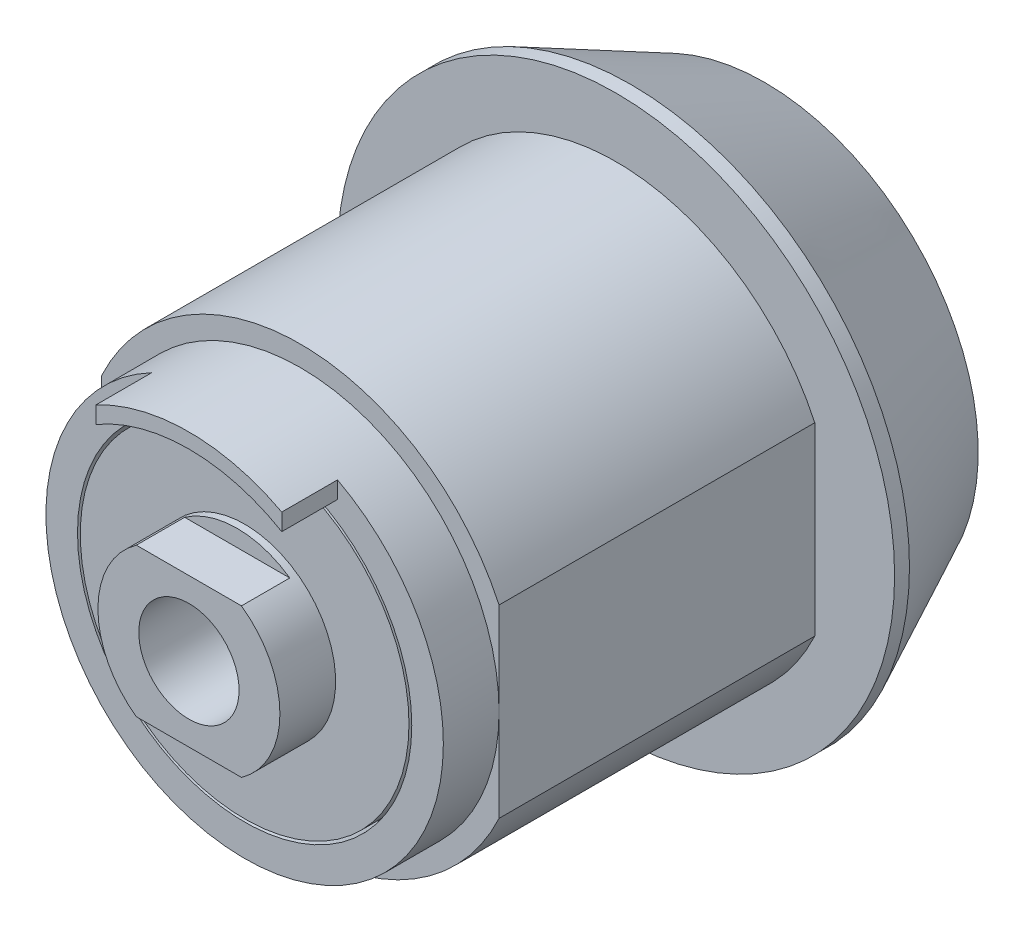
ISO-10303-21;
HEADER;
FILE_DESCRIPTION(('STEP AP214'),'2;1');
FILE_NAME('part.step','',(''),(''),'','','');
FILE_SCHEMA(('AUTOMOTIVE_DESIGN { 1 0 10303 214 1 1 1 1 }'));
ENDSEC;
DATA;
#1=APPLICATION_CONTEXT('core data for automotive mechanical design processes');
#2=APPLICATION_PROTOCOL_DEFINITION('international standard','automotive_design',2000,#1);
#3=PRODUCT_CONTEXT('',#1,'mechanical');
#4=PRODUCT('Part','Part','',(#3));
#5=PRODUCT_RELATED_PRODUCT_CATEGORY('part','',(#4));
#6=PRODUCT_DEFINITION_FORMATION('','',#4);
#7=PRODUCT_DEFINITION_CONTEXT('part definition',#1,'design');
#8=PRODUCT_DEFINITION('design','',#6,#7);
#9=PRODUCT_DEFINITION_SHAPE('','',#8);
#10=(LENGTH_UNIT() NAMED_UNIT(*) SI_UNIT(.MILLI.,.METRE.));
#11=(NAMED_UNIT(*) PLANE_ANGLE_UNIT() SI_UNIT($,.RADIAN.));
#12=(NAMED_UNIT(*) SI_UNIT($,.STERADIAN.) SOLID_ANGLE_UNIT());
#13=UNCERTAINTY_MEASURE_WITH_UNIT(LENGTH_MEASURE(1.E-05),#10,'distance_accuracy_value','');
#14=(GEOMETRIC_REPRESENTATION_CONTEXT(3) GLOBAL_UNCERTAINTY_ASSIGNED_CONTEXT((#13)) GLOBAL_UNIT_ASSIGNED_CONTEXT((#10,
#11,#12)) REPRESENTATION_CONTEXT('',''));
#15=CARTESIAN_POINT('',(0.,0.,0.));
#16=DIRECTION('',(0.,0.,1.));
#17=DIRECTION('',(1.,0.,0.));
#18=AXIS2_PLACEMENT_3D('',#15,#16,#17);
#19=CARTESIAN_POINT('',(0.,0.,10.5));
#20=DIRECTION('',(0.,0.,1.));
#21=DIRECTION('',(1.,0.,0.));
#22=AXIS2_PLACEMENT_3D('',#19,#20,#21);
#23=PLANE('',#22);
#24=CARTESIAN_POINT('',(0.,0.,10.5));
#25=DIRECTION('',(0.,0.,1.));
#26=DIRECTION('',(1.,0.,0.));
#27=AXIS2_PLACEMENT_3D('',#24,#25,#26);
#28=CIRCLE('',#27,1.35);
#29=CARTESIAN_POINT('',(1.35,0.,10.5));
#30=VERTEX_POINT('',#29);
#31=EDGE_CURVE('E19',#30,#30,#28,.T.);
#32=ORIENTED_EDGE('',*,*,#31,.T.);
#33=EDGE_LOOP('',(#32));
#34=FACE_BOUND('',#33,.T.);
#35=ADVANCED_FACE('F16',(#34),#23,.T.);
#36=CARTESIAN_POINT('',(0.,0.,10.5));
#37=DIRECTION('',(0.,0.,1.));
#38=DIRECTION('',(1.,0.,0.));
#39=AXIS2_PLACEMENT_3D('',#36,#37,#38);
#40=CYLINDRICAL_SURFACE('',#39,1.35);
#41=CARTESIAN_POINT('',(0.,0.,15.5));
#42=DIRECTION('',(0.,0.,1.));
#43=DIRECTION('',(1.,0.,0.));
#44=AXIS2_PLACEMENT_3D('',#41,#42,#43);
#45=CIRCLE('',#44,1.35);
#46=CARTESIAN_POINT('',(1.35,0.,15.5));
#47=VERTEX_POINT('',#46);
#48=EDGE_CURVE('E176',#47,#47,#45,.F.);
#49=ORIENTED_EDGE('',*,*,#48,.F.);
#50=EDGE_LOOP('',(#49));
#51=FACE_BOUND('',#50,.T.);
#52=ORIENTED_EDGE('',*,*,#31,.F.);
#53=EDGE_LOOP('',(#52));
#54=FACE_BOUND('',#53,.T.);
#55=ADVANCED_FACE('F760',(#51,#54),#40,.F.);
#56=CARTESIAN_POINT('',(-1.41509716980849,-2.,15.5));
#57=DIRECTION('',(0.,1.,0.));
#58=DIRECTION('',(0.,0.,1.));
#59=AXIS2_PLACEMENT_3D('',#56,#57,#58);
#60=PLANE('',#59);
#61=DIRECTION('',(1.,0.,0.));
#62=VECTOR('',#61,1.);
#63=CARTESIAN_POINT('',(0.,-2.,14.2));
#64=LINE('',#63,#62);
#65=CARTESIAN_POINT('',(1.41509716980849,-2.,14.2));
#66=VERTEX_POINT('',#65);
#67=CARTESIAN_POINT('',(-1.41509716980849,-2.,14.2));
#68=VERTEX_POINT('',#67);
#69=EDGE_CURVE('E163',#66,#68,#64,.F.);
#70=ORIENTED_EDGE('',*,*,#69,.F.);
#71=DIRECTION('',(0.,0.,1.));
#72=VECTOR('',#71,1.);
#73=CARTESIAN_POINT('',(1.41509716980849,-2.,15.5));
#74=LINE('',#73,#72);
#75=CARTESIAN_POINT('',(1.41509716980849,-2.,15.5));
#76=VERTEX_POINT('',#75);
#77=EDGE_CURVE('E171',#76,#66,#74,.F.);
#78=ORIENTED_EDGE('',*,*,#77,.F.);
#79=DIRECTION('',(1.,0.,0.));
#80=VECTOR('',#79,1.);
#81=CARTESIAN_POINT('',(0.,-2.,15.5));
#82=LINE('',#81,#80);
#83=CARTESIAN_POINT('',(-1.41509716980849,-2.,15.5));
#84=VERTEX_POINT('',#83);
#85=EDGE_CURVE('E166',#84,#76,#82,.T.);
#86=ORIENTED_EDGE('',*,*,#85,.F.);
#87=DIRECTION('',(0.,0.,1.));
#88=VECTOR('',#87,1.);
#89=CARTESIAN_POINT('',(-1.41509716980849,-2.,15.5));
#90=LINE('',#89,#88);
#91=EDGE_CURVE('E159',#68,#84,#90,.T.);
#92=ORIENTED_EDGE('',*,*,#91,.F.);
#93=EDGE_LOOP('',(#70,#78,#86,#92));
#94=FACE_BOUND('',#93,.T.);
#95=ADVANCED_FACE('F161',(#94),#60,.F.);
#96=CARTESIAN_POINT('',(-1.41509716980849,2.,15.5));
#97=DIRECTION('',(0.,-1.,0.));
#98=DIRECTION('',(0.,0.,-1.));
#99=AXIS2_PLACEMENT_3D('',#96,#97,#98);
#100=PLANE('',#99);
#101=DIRECTION('',(1.,0.,0.));
#102=VECTOR('',#101,1.);
#103=CARTESIAN_POINT('',(0.,2.,14.2));
#104=LINE('',#103,#102);
#105=CARTESIAN_POINT('',(-1.41509716980849,2.,14.2));
#106=VERTEX_POINT('',#105);
#107=CARTESIAN_POINT('',(1.41509716980849,2.,14.2));
#108=VERTEX_POINT('',#107);
#109=EDGE_CURVE('E199',#106,#108,#104,.T.);
#110=ORIENTED_EDGE('',*,*,#109,.F.);
#111=DIRECTION('',(0.,0.,-1.));
#112=VECTOR('',#111,1.);
#113=CARTESIAN_POINT('',(-1.41509716980849,2.,15.5));
#114=LINE('',#113,#112);
#115=CARTESIAN_POINT('',(-1.41509716980849,2.,15.5));
#116=VERTEX_POINT('',#115);
#117=EDGE_CURVE('E170',#116,#106,#114,.T.);
#118=ORIENTED_EDGE('',*,*,#117,.F.);
#119=DIRECTION('',(1.,0.,0.));
#120=VECTOR('',#119,1.);
#121=CARTESIAN_POINT('',(0.,2.,15.5));
#122=LINE('',#121,#120);
#123=CARTESIAN_POINT('',(1.41509716980849,2.,15.5));
#124=VERTEX_POINT('',#123);
#125=EDGE_CURVE('E194',#124,#116,#122,.F.);
#126=ORIENTED_EDGE('',*,*,#125,.F.);
#127=DIRECTION('',(0.,0.,-1.));
#128=VECTOR('',#127,1.);
#129=CARTESIAN_POINT('',(1.41509716980849,2.,15.5));
#130=LINE('',#129,#128);
#131=EDGE_CURVE('E177',#108,#124,#130,.F.);
#132=ORIENTED_EDGE('',*,*,#131,.F.);
#133=EDGE_LOOP('',(#110,#118,#126,#132));
#134=FACE_BOUND('',#133,.T.);
#135=ADVANCED_FACE('F321',(#134),#100,.F.);
#136=CARTESIAN_POINT('',(0.,0.,14.2));
#137=DIRECTION('',(0.,0.,1.));
#138=DIRECTION('',(1.,0.,0.));
#139=AXIS2_PLACEMENT_3D('',#136,#137,#138);
#140=PLANE('',#139);
#141=ORIENTED_EDGE('',*,*,#69,.T.);
#142=CARTESIAN_POINT('',(0.,0.,14.2));
#143=DIRECTION('',(0.,0.,-1.));
#144=DIRECTION('',(-1.,0.,0.));
#145=AXIS2_PLACEMENT_3D('',#142,#143,#144);
#146=CIRCLE('',#145,2.45);
#147=EDGE_CURVE('E175',#66,#68,#146,.T.);
#148=ORIENTED_EDGE('',*,*,#147,.F.);
#149=EDGE_LOOP('',(#141,#148));
#150=FACE_BOUND('',#149,.T.);
#151=ADVANCED_FACE('F174',(#150),#140,.T.);
#152=CARTESIAN_POINT('',(0.,0.,15.5));
#153=DIRECTION('',(0.,0.,1.));
#154=DIRECTION('',(1.,0.,0.));
#155=AXIS2_PLACEMENT_3D('',#152,#153,#154);
#156=PLANE('',#155);
#157=CARTESIAN_POINT('',(0.,0.,15.5));
#158=DIRECTION('',(0.,0.,-1.));
#159=DIRECTION('',(-1.,0.,0.));
#160=AXIS2_PLACEMENT_3D('',#157,#158,#159);
#161=CIRCLE('',#160,2.45);
#162=EDGE_CURVE('E182',#124,#76,#161,.T.);
#163=ORIENTED_EDGE('',*,*,#162,.F.);
#164=ORIENTED_EDGE('',*,*,#125,.T.);
#165=CARTESIAN_POINT('',(0.,0.,15.5));
#166=DIRECTION('',(0.,0.,-1.));
#167=DIRECTION('',(-1.,0.,0.));
#168=AXIS2_PLACEMENT_3D('',#165,#166,#167);
#169=CIRCLE('',#168,2.45);
#170=EDGE_CURVE('E185',#84,#116,#169,.T.);
#171=ORIENTED_EDGE('',*,*,#170,.F.);
#172=ORIENTED_EDGE('',*,*,#85,.T.);
#173=EDGE_LOOP('',(#163,#164,#171,#172));
#174=FACE_BOUND('',#173,.T.);
#175=ORIENTED_EDGE('',*,*,#48,.T.);
#176=EDGE_LOOP('',(#175));
#177=FACE_BOUND('',#176,.T.);
#178=ADVANCED_FACE('F318',(#174,#177),#156,.T.);
#179=CARTESIAN_POINT('',(0.,0.,14.2));
#180=DIRECTION('',(0.,0.,1.));
#181=DIRECTION('',(1.,0.,0.));
#182=AXIS2_PLACEMENT_3D('',#179,#180,#181);
#183=PLANE('',#182);
#184=ORIENTED_EDGE('',*,*,#109,.T.);
#185=CARTESIAN_POINT('',(0.,0.,14.2));
#186=DIRECTION('',(0.,0.,-1.));
#187=DIRECTION('',(-1.,0.,0.));
#188=AXIS2_PLACEMENT_3D('',#185,#186,#187);
#189=CIRCLE('',#188,2.45);
#190=EDGE_CURVE('E315',#106,#108,#189,.T.);
#191=ORIENTED_EDGE('',*,*,#190,.F.);
#192=EDGE_LOOP('',(#184,#191));
#193=FACE_BOUND('',#192,.T.);
#194=ADVANCED_FACE('F326',(#193),#183,.T.);
#195=CARTESIAN_POINT('',(0.,0.,0.));
#196=DIRECTION('',(0.,0.,1.));
#197=DIRECTION('',(1.,0.,0.));
#198=AXIS2_PLACEMENT_3D('',#195,#196,#197);
#199=PLANE('',#198);
#200=CARTESIAN_POINT('',(0.,0.,0.));
#201=DIRECTION('',(0.,0.,1.));
#202=DIRECTION('',(0.,-1.,0.));
#203=AXIS2_PLACEMENT_3D('',#200,#201,#202);
#204=CIRCLE('',#203,2.29999999999109);
#205=CARTESIAN_POINT('',(2.22036033110822,0.6,0.));
#206=VERTEX_POINT('',#205);
#207=CARTESIAN_POINT('',(2.22036033110822,-0.6,0.));
#208=VERTEX_POINT('',#207);
#209=EDGE_CURVE('E294',#206,#208,#204,.T.);
#210=ORIENTED_EDGE('',*,*,#209,.F.);
#211=DIRECTION('',(1.,0.,0.));
#212=VECTOR('',#211,1.);
#213=CARTESIAN_POINT('',(4.5,0.6,0.));
#214=LINE('',#213,#212);
#215=CARTESIAN_POINT('',(1.75,0.6,0.));
#216=VERTEX_POINT('',#215);
#217=EDGE_CURVE('E314',#206,#216,#214,.F.);
#218=ORIENTED_EDGE('',*,*,#217,.T.);
#219=DIRECTION('',(0.,1.,0.));
#220=VECTOR('',#219,1.);
#221=CARTESIAN_POINT('',(1.75,0.6,0.));
#222=LINE('',#221,#220);
#223=CARTESIAN_POINT('',(1.75,-0.6,0.));
#224=VERTEX_POINT('',#223);
#225=EDGE_CURVE('E188',#216,#224,#222,.F.);
#226=ORIENTED_EDGE('',*,*,#225,.T.);
#227=DIRECTION('',(1.,0.,0.));
#228=VECTOR('',#227,1.);
#229=CARTESIAN_POINT('',(0.,-0.6,0.));
#230=LINE('',#229,#228);
#231=EDGE_CURVE('E325',#208,#224,#230,.F.);
#232=ORIENTED_EDGE('',*,*,#231,.F.);
#233=EDGE_LOOP('',(#210,#218,#226,#232));
#234=FACE_BOUND('',#233,.T.);
#235=ADVANCED_FACE('F328',(#234),#199,.F.);
#236=CARTESIAN_POINT('',(1.75,0.6,8.0004166377355));
#237=DIRECTION('',(-1.,0.,0.));
#238=DIRECTION('',(0.,0.,1.));
#239=AXIS2_PLACEMENT_3D('',#236,#237,#238);
#240=PLANE('',#239);
#241=DIRECTION('',(0.,0.,-1.));
#242=VECTOR('',#241,1.);
#243=CARTESIAN_POINT('',(1.75,-0.6,8.0004166377355));
#244=LINE('',#243,#242);
#245=CARTESIAN_POINT('',(1.75,-0.6,5.));
#246=VERTEX_POINT('',#245);
#247=EDGE_CURVE('E293',#246,#224,#244,.T.);
#248=ORIENTED_EDGE('',*,*,#247,.T.);
#249=ORIENTED_EDGE('',*,*,#225,.F.);
#250=DIRECTION('',(0.,0.,1.));
#251=VECTOR('',#250,1.);
#252=CARTESIAN_POINT('',(1.75,0.6,8.0004166377355));
#253=LINE('',#252,#251);
#254=CARTESIAN_POINT('',(1.75,0.6,5.));
#255=VERTEX_POINT('',#254);
#256=EDGE_CURVE('E316',#216,#255,#253,.T.);
#257=ORIENTED_EDGE('',*,*,#256,.T.);
#258=DIRECTION('',(0.,1.,0.));
#259=VECTOR('',#258,1.);
#260=CARTESIAN_POINT('',(1.75,0.6,5.));
#261=LINE('',#260,#259);
#262=EDGE_CURVE('E183',#246,#255,#261,.T.);
#263=ORIENTED_EDGE('',*,*,#262,.F.);
#264=EDGE_LOOP('',(#248,#249,#257,#263));
#265=FACE_BOUND('',#264,.T.);
#266=ADVANCED_FACE('F335',(#265),#240,.F.);
#267=CARTESIAN_POINT('',(0.,0.,15.5));
#268=DIRECTION('',(0.,0.,-1.));
#269=DIRECTION('',(-1.,0.,0.));
#270=AXIS2_PLACEMENT_3D('',#267,#268,#269);
#271=CYLINDRICAL_SURFACE('',#270,2.45);
#272=CARTESIAN_POINT('',(0.,0.,14.));
#273=DIRECTION('',(0.,0.,-1.));
#274=DIRECTION('',(-1.,0.,0.));
#275=AXIS2_PLACEMENT_3D('',#272,#273,#274);
#276=CIRCLE('',#275,2.45);
#277=CARTESIAN_POINT('',(-2.45,0.,14.));
#278=VERTEX_POINT('',#277);
#279=EDGE_CURVE('E282',#278,#278,#276,.T.);
#280=ORIENTED_EDGE('',*,*,#279,.F.);
#281=EDGE_LOOP('',(#280));
#282=FACE_BOUND('',#281,.T.);
#283=ORIENTED_EDGE('',*,*,#190,.T.);
#284=ORIENTED_EDGE('',*,*,#131,.T.);
#285=ORIENTED_EDGE('',*,*,#162,.T.);
#286=ORIENTED_EDGE('',*,*,#77,.T.);
#287=ORIENTED_EDGE('',*,*,#147,.T.);
#288=ORIENTED_EDGE('',*,*,#91,.T.);
#289=ORIENTED_EDGE('',*,*,#170,.T.);
#290=ORIENTED_EDGE('',*,*,#117,.T.);
#291=EDGE_LOOP('',(#283,#284,#285,#286,#287,#288,#289,#290));
#292=FACE_BOUND('',#291,.T.);
#293=ADVANCED_FACE('F180',(#282,#292),#271,.T.);
#294=CARTESIAN_POINT('',(4.5,0.6,8.0004166377355));
#295=DIRECTION('',(0.,1.,0.));
#296=DIRECTION('',(0.,0.,1.));
#297=AXIS2_PLACEMENT_3D('',#294,#295,#296);
#298=PLANE('',#297);
#299=CARTESIAN_POINT('',(2.63248931621759,0.6,0.400000000008869));
#300=CARTESIAN_POINT('',(2.56396525927051,0.6,0.333164266625738));
#301=CARTESIAN_POINT('',(2.4953591528772,0.6,0.266413070630083));
#302=CARTESIAN_POINT('',(2.35798282454789,0.6,0.133079737253487));
#303=CARTESIAN_POINT('',(2.28921260257211,0.6,0.0664975999135306));
#304=CARTESIAN_POINT('',(2.22036033111033,0.6,2.0335586174442E-12));
#305=B_SPLINE_CURVE_WITH_KNOTS('',3,(#299,#300,#301,#302,#303,#304),.UNSPECIFIED.,.F.,.F.,(4,2,
4),(0.,0.287163159217367,0.574326388044106),.UNSPECIFIED.);
#306=CARTESIAN_POINT('',(2.63248931621761,0.6,0.400000000004435));
#307=VERTEX_POINT('',#306);
#308=EDGE_CURVE('E308',#307,#206,#305,.T.);
#309=ORIENTED_EDGE('',*,*,#308,.F.);
#310=DIRECTION('',(0.,0.,-1.));
#311=VECTOR('',#310,1.);
#312=CARTESIAN_POINT('',(2.63248931621764,0.6,5.));
#313=LINE('',#312,#311);
#314=CARTESIAN_POINT('',(2.63248931621764,0.6,5.));
#315=VERTEX_POINT('',#314);
#316=EDGE_CURVE('E527',#315,#307,#313,.T.);
#317=ORIENTED_EDGE('',*,*,#316,.F.);
#318=DIRECTION('',(1.,0.,0.));
#319=VECTOR('',#318,1.);
#320=CARTESIAN_POINT('',(4.5,0.6,5.));
#321=LINE('',#320,#319);
#322=EDGE_CURVE('E499',#255,#315,#321,.T.);
#323=ORIENTED_EDGE('',*,*,#322,.F.);
#324=ORIENTED_EDGE('',*,*,#256,.F.);
#325=ORIENTED_EDGE('',*,*,#217,.F.);
#326=EDGE_LOOP('',(#309,#317,#323,#324,#325));
#327=FACE_BOUND('',#326,.T.);
#328=ADVANCED_FACE('F303',(#327),#298,.F.);
#329=CARTESIAN_POINT('',(0.,0.,0.399999999899592));
#330=DIRECTION('',(0.,0.,1.));
#331=DIRECTION('',(0.,-1.,0.));
#332=AXIS2_PLACEMENT_3D('',#329,#330,#331);
#333=CONICAL_SURFACE('',#332,2.69999999989068,0.785398163397448);
#334=ORIENTED_EDGE('',*,*,#308,.T.);
#335=ORIENTED_EDGE('',*,*,#209,.T.);
#336=CARTESIAN_POINT('',(2.22036033111211,-0.6,3.75291312388091E-12));
#337=CARTESIAN_POINT('',(2.28921260257286,-0.6,0.0664975999142519));
#338=CARTESIAN_POINT('',(2.3579828245476,-0.6,0.133079737253208));
#339=CARTESIAN_POINT('',(2.49535915287485,-0.6,0.266413070627798));
#340=CARTESIAN_POINT('',(2.56396525926713,-0.6,0.333164266622447));
#341=CARTESIAN_POINT('',(2.63248931621318,-0.6,0.40000000000457));
#342=B_SPLINE_CURVE_WITH_KNOTS('',3,(#336,#337,#338,#339,#340,#341),.UNSPECIFIED.,.F.,.F.,(4,2,
4),(0.,0.287163228822422,0.574326388035472),.UNSPECIFIED.);
#343=CARTESIAN_POINT('',(2.63248931621541,-0.6,0.400000000002285));
#344=VERTEX_POINT('',#343);
#345=EDGE_CURVE('E286',#208,#344,#342,.T.);
#346=ORIENTED_EDGE('',*,*,#345,.T.);
#347=CARTESIAN_POINT('',(0.,0.,0.4));
#348=DIRECTION('',(0.,0.,-1.));
#349=DIRECTION('',(-1.,0.,0.));
#350=AXIS2_PLACEMENT_3D('',#347,#348,#349);
#351=CIRCLE('',#350,2.7);
#352=EDGE_CURVE('E525',#307,#344,#351,.F.);
#353=ORIENTED_EDGE('',*,*,#352,.F.);
#354=EDGE_LOOP('',(#334,#335,#346,#353));
#355=FACE_BOUND('',#354,.T.);
#356=ADVANCED_FACE('F299',(#355),#333,.T.);
#357=CARTESIAN_POINT('',(4.5,-0.6,8.0004166377355));
#358=DIRECTION('',(0.,-1.,0.));
#359=DIRECTION('',(0.,0.,-1.));
#360=AXIS2_PLACEMENT_3D('',#357,#358,#359);
#361=PLANE('',#360);
#362=ORIENTED_EDGE('',*,*,#345,.F.);
#363=ORIENTED_EDGE('',*,*,#231,.T.);
#364=ORIENTED_EDGE('',*,*,#247,.F.);
#365=DIRECTION('',(1.,0.,0.));
#366=VECTOR('',#365,1.);
#367=CARTESIAN_POINT('',(4.5,-0.6,5.));
#368=LINE('',#367,#366);
#369=CARTESIAN_POINT('',(2.63248931621764,-0.6,5.));
#370=VERTEX_POINT('',#369);
#371=EDGE_CURVE('E486',#370,#246,#368,.F.);
#372=ORIENTED_EDGE('',*,*,#371,.F.);
#373=DIRECTION('',(0.,0.,-1.));
#374=VECTOR('',#373,1.);
#375=CARTESIAN_POINT('',(2.63248931621764,-0.6,5.));
#376=LINE('',#375,#374);
#377=EDGE_CURVE('E281',#344,#370,#376,.F.);
#378=ORIENTED_EDGE('',*,*,#377,.F.);
#379=EDGE_LOOP('',(#362,#363,#364,#372,#378));
#380=FACE_BOUND('',#379,.T.);
#381=ADVANCED_FACE('F296',(#380),#361,.F.);
#382=CARTESIAN_POINT('',(0.,0.,14.));
#383=DIRECTION('',(0.,0.,1.));
#384=DIRECTION('',(1.,0.,0.));
#385=AXIS2_PLACEMENT_3D('',#382,#383,#384);
#386=PLANE('',#385);
#387=CARTESIAN_POINT('',(0.,0.,14.));
#388=DIRECTION('',(0.,0.,1.));
#389=DIRECTION('',(1.,0.,0.));
#390=AXIS2_PLACEMENT_3D('',#387,#388,#389);
#391=CIRCLE('',#390,4.425);
#392=CARTESIAN_POINT('',(4.425,0.,14.));
#393=VERTEX_POINT('',#392);
#394=EDGE_CURVE('E277',#393,#393,#391,.F.);
#395=ORIENTED_EDGE('',*,*,#394,.F.);
#396=EDGE_LOOP('',(#395));
#397=FACE_BOUND('',#396,.T.);
#398=ORIENTED_EDGE('',*,*,#279,.T.);
#399=EDGE_LOOP('',(#398));
#400=FACE_BOUND('',#399,.T.);
#401=ADVANCED_FACE('F456',(#397,#400),#386,.T.);
#402=CARTESIAN_POINT('',(0.6,-4.5,8.0004166377355));
#403=DIRECTION('',(0.,-1.,0.));
#404=DIRECTION('',(0.,0.,-1.));
#405=AXIS2_PLACEMENT_3D('',#402,#403,#404);
#406=PLANE('',#405);
#407=DIRECTION('',(0.,0.,1.));
#408=VECTOR('',#407,1.);
#409=CARTESIAN_POINT('',(0.6,-4.5,8.0004166377355));
#410=LINE('',#409,#408);
#411=CARTESIAN_POINT('',(0.6,-4.5,5.));
#412=VERTEX_POINT('',#411);
#413=CARTESIAN_POINT('',(0.6,-4.5,0.));
#414=VERTEX_POINT('',#413);
#415=EDGE_CURVE('E280',#412,#414,#410,.F.);
#416=ORIENTED_EDGE('',*,*,#415,.T.);
#417=DIRECTION('',(1.,0.,0.));
#418=VECTOR('',#417,1.);
#419=CARTESIAN_POINT('',(0.6,-4.5,0.));
#420=LINE('',#419,#418);
#421=CARTESIAN_POINT('',(-0.6,-4.5,0.));
#422=VERTEX_POINT('',#421);
#423=EDGE_CURVE('E285',#422,#414,#420,.T.);
#424=ORIENTED_EDGE('',*,*,#423,.F.);
#425=DIRECTION('',(0.,0.,1.));
#426=VECTOR('',#425,1.);
#427=CARTESIAN_POINT('',(-0.6,-4.5,8.0004166377355));
#428=LINE('',#427,#426);
#429=CARTESIAN_POINT('',(-0.6,-4.5,5.));
#430=VERTEX_POINT('',#429);
#431=EDGE_CURVE('E535',#422,#430,#428,.T.);
#432=ORIENTED_EDGE('',*,*,#431,.T.);
#433=DIRECTION('',(1.,0.,0.));
#434=VECTOR('',#433,1.);
#435=CARTESIAN_POINT('',(0.6,-4.5,5.));
#436=LINE('',#435,#434);
#437=EDGE_CURVE('E565',#412,#430,#436,.F.);
#438=ORIENTED_EDGE('',*,*,#437,.F.);
#439=EDGE_LOOP('',(#416,#424,#432,#438));
#440=FACE_BOUND('',#439,.T.);
#441=ADVANCED_FACE('F453',(#440),#406,.F.);
#442=CARTESIAN_POINT('',(4.5,0.6,8.0004166377355));
#443=DIRECTION('',(1.,0.,0.));
#444=DIRECTION('',(0.,0.,-1.));
#445=AXIS2_PLACEMENT_3D('',#442,#443,#444);
#446=PLANE('',#445);
#447=DIRECTION('',(0.,0.,1.));
#448=VECTOR('',#447,1.);
#449=CARTESIAN_POINT('',(4.5,0.6,8.0004166377355));
#450=LINE('',#449,#448);
#451=CARTESIAN_POINT('',(4.5,0.6,5.));
#452=VERTEX_POINT('',#451);
#453=CARTESIAN_POINT('',(4.5,0.6,0.));
#454=VERTEX_POINT('',#453);
#455=EDGE_CURVE('E538',#452,#454,#450,.F.);
#456=ORIENTED_EDGE('',*,*,#455,.T.);
#457=DIRECTION('',(0.,1.,0.));
#458=VECTOR('',#457,1.);
#459=CARTESIAN_POINT('',(4.5,0.6,0.));
#460=LINE('',#459,#458);
#461=CARTESIAN_POINT('',(4.5,-0.6,0.));
#462=VERTEX_POINT('',#461);
#463=EDGE_CURVE('E560',#462,#454,#460,.T.);
#464=ORIENTED_EDGE('',*,*,#463,.F.);
#465=DIRECTION('',(0.,0.,-1.));
#466=VECTOR('',#465,1.);
#467=CARTESIAN_POINT('',(4.5,-0.6,8.0004166377355));
#468=LINE('',#467,#466);
#469=CARTESIAN_POINT('',(4.5,-0.6,5.));
#470=VERTEX_POINT('',#469);
#471=EDGE_CURVE('E547',#462,#470,#468,.F.);
#472=ORIENTED_EDGE('',*,*,#471,.T.);
#473=DIRECTION('',(0.,1.,0.));
#474=VECTOR('',#473,1.);
#475=CARTESIAN_POINT('',(4.5,0.6,5.));
#476=LINE('',#475,#474);
#477=EDGE_CURVE('E534',#452,#470,#476,.F.);
#478=ORIENTED_EDGE('',*,*,#477,.F.);
#479=EDGE_LOOP('',(#456,#464,#472,#478));
#480=FACE_BOUND('',#479,.T.);
#481=ADVANCED_FACE('F449',(#480),#446,.F.);
#482=CARTESIAN_POINT('',(0.,0.,5.));
#483=DIRECTION('',(0.,0.,-1.));
#484=DIRECTION('',(-1.,0.,0.));
#485=AXIS2_PLACEMENT_3D('',#482,#483,#484);
#486=CYLINDRICAL_SURFACE('',#485,2.7);
#487=ORIENTED_EDGE('',*,*,#352,.T.);
#488=ORIENTED_EDGE('',*,*,#377,.T.);
#489=CARTESIAN_POINT('',(0.,0.,5.));
#490=DIRECTION('',(0.,0.,-1.));
#491=DIRECTION('',(-1.,0.,0.));
#492=AXIS2_PLACEMENT_3D('',#489,#490,#491);
#493=CIRCLE('',#492,2.7);
#494=EDGE_CURVE('E273',#315,#370,#493,.F.);
#495=ORIENTED_EDGE('',*,*,#494,.F.);
#496=ORIENTED_EDGE('',*,*,#316,.T.);
#497=EDGE_LOOP('',(#487,#488,#495,#496));
#498=FACE_BOUND('',#497,.T.);
#499=ADVANCED_FACE('F445',(#498),#486,.T.);
#500=CARTESIAN_POINT('',(0.,0.,13.));
#501=DIRECTION('',(0.,0.,1.));
#502=DIRECTION('',(1.,0.,0.));
#503=AXIS2_PLACEMENT_3D('',#500,#501,#502);
#504=CYLINDRICAL_SURFACE('',#503,4.425);
#505=CARTESIAN_POINT('',(0.,0.,13.));
#506=DIRECTION('',(0.,0.,1.));
#507=DIRECTION('',(1.,0.,0.));
#508=AXIS2_PLACEMENT_3D('',#505,#506,#507);
#509=CIRCLE('',#508,4.425);
#510=CARTESIAN_POINT('',(4.425,0.,13.));
#511=VERTEX_POINT('',#510);
#512=EDGE_CURVE('E269',#511,#511,#509,.F.);
#513=ORIENTED_EDGE('',*,*,#512,.F.);
#514=EDGE_LOOP('',(#513));
#515=FACE_BOUND('',#514,.T.);
#516=ORIENTED_EDGE('',*,*,#394,.T.);
#517=EDGE_LOOP('',(#516));
#518=FACE_BOUND('',#517,.T.);
#519=ADVANCED_FACE('F441',(#515,#518),#504,.T.);
#520=CARTESIAN_POINT('',(0.6,-3.,8.0004166377355));
#521=DIRECTION('',(1.,0.,0.));
#522=DIRECTION('',(0.,1.,0.));
#523=AXIS2_PLACEMENT_3D('',#520,#521,#522);
#524=PLANE('',#523);
#525=ORIENTED_EDGE('',*,*,#415,.F.);
#526=DIRECTION('',(0.,1.,0.));
#527=VECTOR('',#526,1.);
#528=CARTESIAN_POINT('',(0.6,0.,5.));
#529=LINE('',#528,#527);
#530=CARTESIAN_POINT('',(0.599999999999999,-3.54964786985977,5.));
#531=VERTEX_POINT('',#530);
#532=EDGE_CURVE('E617',#531,#412,#529,.F.);
#533=ORIENTED_EDGE('',*,*,#532,.F.);
#534=DIRECTION('',(0.,0.,-1.));
#535=VECTOR('',#534,1.);
#536=CARTESIAN_POINT('',(0.599999999999999,-3.54964786985977,5.));
#537=LINE('',#536,#535);
#538=CARTESIAN_POINT('',(0.599999999999999,-3.54964786985977,0.));
#539=VERTEX_POINT('',#538);
#540=EDGE_CURVE('E272',#531,#539,#537,.T.);
#541=ORIENTED_EDGE('',*,*,#540,.T.);
#542=DIRECTION('',(0.,1.,0.));
#543=VECTOR('',#542,1.);
#544=CARTESIAN_POINT('',(0.6,-3.,0.));
#545=LINE('',#544,#543);
#546=EDGE_CURVE('E544',#414,#539,#545,.T.);
#547=ORIENTED_EDGE('',*,*,#546,.F.);
#548=EDGE_LOOP('',(#525,#533,#541,#547));
#549=FACE_BOUND('',#548,.T.);
#550=ADVANCED_FACE('F437',(#549),#524,.F.);
#551=CARTESIAN_POINT('',(4.5,-0.6,8.0004166377355));
#552=DIRECTION('',(0.,-1.,0.));
#553=DIRECTION('',(0.,0.,-1.));
#554=AXIS2_PLACEMENT_3D('',#551,#552,#553);
#555=PLANE('',#554);
#556=ORIENTED_EDGE('',*,*,#471,.F.);
#557=DIRECTION('',(1.,0.,0.));
#558=VECTOR('',#557,1.);
#559=CARTESIAN_POINT('',(4.5,-0.6,0.));
#560=LINE('',#559,#558);
#561=CARTESIAN_POINT('',(3.54964786985977,-0.6,0.));
#562=VERTEX_POINT('',#561);
#563=EDGE_CURVE('E550',#562,#462,#560,.T.);
#564=ORIENTED_EDGE('',*,*,#563,.F.);
#565=DIRECTION('',(0.,0.,-1.));
#566=VECTOR('',#565,1.);
#567=CARTESIAN_POINT('',(3.54964786985977,-0.6,5.));
#568=LINE('',#567,#566);
#569=CARTESIAN_POINT('',(3.54964786985977,-0.6,5.));
#570=VERTEX_POINT('',#569);
#571=EDGE_CURVE('E268',#562,#570,#568,.F.);
#572=ORIENTED_EDGE('',*,*,#571,.T.);
#573=DIRECTION('',(-1.,0.,0.));
#574=VECTOR('',#573,1.);
#575=CARTESIAN_POINT('',(0.,-0.6,5.));
#576=LINE('',#575,#574);
#577=EDGE_CURVE('E612',#470,#570,#576,.T.);
#578=ORIENTED_EDGE('',*,*,#577,.F.);
#579=EDGE_LOOP('',(#556,#564,#572,#578));
#580=FACE_BOUND('',#579,.T.);
#581=ADVANCED_FACE('F433',(#580),#555,.F.);
#582=CARTESIAN_POINT('',(-0.6,-3.,8.0004166377355));
#583=DIRECTION('',(-1.,0.,0.));
#584=DIRECTION('',(0.,-1.,0.));
#585=AXIS2_PLACEMENT_3D('',#582,#583,#584);
#586=PLANE('',#585);
#587=ORIENTED_EDGE('',*,*,#431,.F.);
#588=DIRECTION('',(0.,-1.,0.));
#589=VECTOR('',#588,1.);
#590=CARTESIAN_POINT('',(-0.6,-3.,0.));
#591=LINE('',#590,#589);
#592=CARTESIAN_POINT('',(-0.599999999999999,-3.54964786985977,0.));
#593=VERTEX_POINT('',#592);
#594=EDGE_CURVE('E539',#593,#422,#591,.T.);
#595=ORIENTED_EDGE('',*,*,#594,.F.);
#596=DIRECTION('',(0.,0.,-1.));
#597=VECTOR('',#596,1.);
#598=CARTESIAN_POINT('',(-0.599999999999998,-3.54964786985977,5.));
#599=LINE('',#598,#597);
#600=CARTESIAN_POINT('',(-0.599999999999999,-3.54964786985977,5.));
#601=VERTEX_POINT('',#600);
#602=EDGE_CURVE('E267',#593,#601,#599,.F.);
#603=ORIENTED_EDGE('',*,*,#602,.T.);
#604=DIRECTION('',(0.,1.,0.));
#605=VECTOR('',#604,1.);
#606=CARTESIAN_POINT('',(-0.6,0.,5.));
#607=LINE('',#606,#605);
#608=EDGE_CURVE('E276',#430,#601,#607,.T.);
#609=ORIENTED_EDGE('',*,*,#608,.F.);
#610=EDGE_LOOP('',(#587,#595,#603,#609));
#611=FACE_BOUND('',#610,.T.);
#612=ADVANCED_FACE('F429',(#611),#586,.F.);
#613=CARTESIAN_POINT('',(4.5,0.6,8.0004166377355));
#614=DIRECTION('',(0.,1.,0.));
#615=DIRECTION('',(0.,0.,1.));
#616=AXIS2_PLACEMENT_3D('',#613,#614,#615);
#617=PLANE('',#616);
#618=ORIENTED_EDGE('',*,*,#455,.F.);
#619=DIRECTION('',(-1.,0.,0.));
#620=VECTOR('',#619,1.);
#621=CARTESIAN_POINT('',(0.,0.6,5.));
#622=LINE('',#621,#620);
#623=CARTESIAN_POINT('',(3.54964786985977,0.6,5.));
#624=VERTEX_POINT('',#623);
#625=EDGE_CURVE('E607',#624,#452,#622,.F.);
#626=ORIENTED_EDGE('',*,*,#625,.F.);
#627=DIRECTION('',(0.,0.,-1.));
#628=VECTOR('',#627,1.);
#629=CARTESIAN_POINT('',(3.54964786985977,0.6,5.));
#630=LINE('',#629,#628);
#631=CARTESIAN_POINT('',(3.54964786985977,0.6,0.));
#632=VERTEX_POINT('',#631);
#633=EDGE_CURVE('E263',#624,#632,#630,.T.);
#634=ORIENTED_EDGE('',*,*,#633,.T.);
#635=DIRECTION('',(1.,0.,0.));
#636=VECTOR('',#635,1.);
#637=CARTESIAN_POINT('',(4.5,0.6,0.));
#638=LINE('',#637,#636);
#639=EDGE_CURVE('E555',#454,#632,#638,.F.);
#640=ORIENTED_EDGE('',*,*,#639,.F.);
#641=EDGE_LOOP('',(#618,#626,#634,#640));
#642=FACE_BOUND('',#641,.T.);
#643=ADVANCED_FACE('F425',(#642),#617,.F.);
#644=CARTESIAN_POINT('',(0.,0.,5.));
#645=DIRECTION('',(0.,0.,-1.));
#646=DIRECTION('',(-1.,0.,0.));
#647=AXIS2_PLACEMENT_3D('',#644,#645,#646);
#648=PLANE('',#647);
#649=ORIENTED_EDGE('',*,*,#371,.T.);
#650=ORIENTED_EDGE('',*,*,#262,.T.);
#651=ORIENTED_EDGE('',*,*,#322,.T.);
#652=ORIENTED_EDGE('',*,*,#494,.T.);
#653=EDGE_LOOP('',(#649,#650,#651,#652));
#654=FACE_BOUND('',#653,.T.);
#655=ORIENTED_EDGE('',*,*,#437,.T.);
#656=ORIENTED_EDGE('',*,*,#608,.T.);
#657=CARTESIAN_POINT('',(0.,0.,5.));
#658=DIRECTION('',(0.,0.,-1.));
#659=DIRECTION('',(-1.,0.,0.));
#660=AXIS2_PLACEMENT_3D('',#657,#658,#659);
#661=CIRCLE('',#660,3.6);
#662=EDGE_CURVE('E260',#601,#624,#661,.T.);
#663=ORIENTED_EDGE('',*,*,#662,.T.);
#664=ORIENTED_EDGE('',*,*,#625,.T.);
#665=ORIENTED_EDGE('',*,*,#477,.T.);
#666=ORIENTED_EDGE('',*,*,#577,.T.);
#667=CARTESIAN_POINT('',(0.,0.,5.));
#668=DIRECTION('',(0.,0.,-1.));
#669=DIRECTION('',(-1.,0.,0.));
#670=AXIS2_PLACEMENT_3D('',#667,#668,#669);
#671=CIRCLE('',#670,3.6);
#672=EDGE_CURVE('E264',#570,#531,#671,.T.);
#673=ORIENTED_EDGE('',*,*,#672,.T.);
#674=ORIENTED_EDGE('',*,*,#532,.T.);
#675=EDGE_LOOP('',(#655,#656,#663,#664,#665,#666,#673,#674));
#676=FACE_BOUND('',#675,.T.);
#677=ADVANCED_FACE('F421',(#654,#676),#648,.T.);
#678=CARTESIAN_POINT('',(0.,0.,13.));
#679=DIRECTION('',(0.,0.,1.));
#680=DIRECTION('',(1.,0.,0.));
#681=AXIS2_PLACEMENT_3D('',#678,#679,#680);
#682=PLANE('',#681);
#683=CARTESIAN_POINT('',(0.,0.,13.));
#684=DIRECTION('',(0.,0.,1.));
#685=DIRECTION('',(1.,0.,0.));
#686=AXIS2_PLACEMENT_3D('',#683,#684,#685);
#687=CIRCLE('',#686,4.5);
#688=CARTESIAN_POINT('',(4.5,0.,13.));
#689=VERTEX_POINT('',#688);
#690=EDGE_CURVE('E257',#689,#689,#687,.T.);
#691=ORIENTED_EDGE('',*,*,#690,.T.);
#692=EDGE_LOOP('',(#691));
#693=FACE_BOUND('',#692,.T.);
#694=ORIENTED_EDGE('',*,*,#512,.T.);
#695=EDGE_LOOP('',(#694));
#696=FACE_BOUND('',#695,.T.);
#697=ADVANCED_FACE('F417',(#693,#696),#682,.T.);
#698=CARTESIAN_POINT('',(0.,0.,5.));
#699=DIRECTION('',(0.,0.,-1.));
#700=DIRECTION('',(-1.,0.,0.));
#701=AXIS2_PLACEMENT_3D('',#698,#699,#700);
#702=CYLINDRICAL_SURFACE('',#701,3.6);
#703=ORIENTED_EDGE('',*,*,#571,.F.);
#704=CARTESIAN_POINT('',(0.,0.,0.));
#705=DIRECTION('',(0.,0.,-1.));
#706=DIRECTION('',(-1.,0.,0.));
#707=AXIS2_PLACEMENT_3D('',#704,#705,#706);
#708=CIRCLE('',#707,3.6);
#709=EDGE_CURVE('E248',#562,#539,#708,.T.);
#710=ORIENTED_EDGE('',*,*,#709,.T.);
#711=ORIENTED_EDGE('',*,*,#540,.F.);
#712=ORIENTED_EDGE('',*,*,#672,.F.);
#713=EDGE_LOOP('',(#703,#710,#711,#712));
#714=FACE_BOUND('',#713,.T.);
#715=ADVANCED_FACE('F413',(#714),#702,.F.);
#716=CARTESIAN_POINT('',(0.,0.,5.));
#717=DIRECTION('',(0.,0.,-1.));
#718=DIRECTION('',(-1.,0.,0.));
#719=AXIS2_PLACEMENT_3D('',#716,#717,#718);
#720=CYLINDRICAL_SURFACE('',#719,3.6);
#721=ORIENTED_EDGE('',*,*,#662,.F.);
#722=ORIENTED_EDGE('',*,*,#602,.F.);
#723=CARTESIAN_POINT('',(0.,0.,0.));
#724=DIRECTION('',(0.,0.,-1.));
#725=DIRECTION('',(-1.,0.,0.));
#726=AXIS2_PLACEMENT_3D('',#723,#724,#725);
#727=CIRCLE('',#726,3.6);
#728=EDGE_CURVE('E245',#593,#632,#727,.T.);
#729=ORIENTED_EDGE('',*,*,#728,.T.);
#730=ORIENTED_EDGE('',*,*,#633,.F.);
#731=EDGE_LOOP('',(#721,#722,#729,#730));
#732=FACE_BOUND('',#731,.T.);
#733=ADVANCED_FACE('F409',(#732),#720,.F.);
#734=CARTESIAN_POINT('',(0.,0.,13.));
#735=DIRECTION('',(0.,0.,1.));
#736=DIRECTION('',(1.,0.,0.));
#737=AXIS2_PLACEMENT_3D('',#734,#735,#736);
#738=CYLINDRICAL_SURFACE('',#737,4.5);
#739=CARTESIAN_POINT('',(0.,0.,14.));
#740=DIRECTION('',(0.,0.,1.));
#741=DIRECTION('',(1.,0.,0.));
#742=AXIS2_PLACEMENT_3D('',#739,#740,#741);
#743=CIRCLE('',#742,4.5);
#744=CARTESIAN_POINT('',(4.5,0.,14.));
#745=VERTEX_POINT('',#744);
#746=EDGE_CURVE('E241',#745,#745,#743,.F.);
#747=ORIENTED_EDGE('',*,*,#746,.F.);
#748=EDGE_LOOP('',(#747));
#749=FACE_BOUND('',#748,.T.);
#750=ORIENTED_EDGE('',*,*,#690,.F.);
#751=EDGE_LOOP('',(#750));
#752=FACE_BOUND('',#751,.T.);
#753=ADVANCED_FACE('F405',(#749,#752),#738,.F.);
#754=CARTESIAN_POINT('',(0.,0.,15.5));
#755=DIRECTION('',(0.,0.,-1.));
#756=DIRECTION('',(-1.,0.,0.));
#757=AXIS2_PLACEMENT_3D('',#754,#755,#756);
#758=CYLINDRICAL_SURFACE('',#757,4.95);
#759=DIRECTION('',(0.,0.,1.));
#760=VECTOR('',#759,1.);
#761=CARTESIAN_POINT('',(2.5,4.27229446550679,15.5));
#762=LINE('',#761,#760);
#763=CARTESIAN_POINT('',(2.5,4.2722944655068,14.));
#764=VERTEX_POINT('',#763);
#765=CARTESIAN_POINT('',(2.5,4.2722944655068,15.5));
#766=VERTEX_POINT('',#765);
#767=EDGE_CURVE('E632',#764,#766,#762,.T.);
#768=ORIENTED_EDGE('',*,*,#767,.T.);
#769=CARTESIAN_POINT('',(0.,0.,15.5));
#770=DIRECTION('',(0.,0.,-1.));
#771=DIRECTION('',(-1.,0.,0.));
#772=AXIS2_PLACEMENT_3D('',#769,#770,#771);
#773=CIRCLE('',#772,4.95);
#774=CARTESIAN_POINT('',(-2.5,4.2722944655068,15.5));
#775=VERTEX_POINT('',#774);
#776=EDGE_CURVE('E252',#775,#766,#773,.T.);
#777=ORIENTED_EDGE('',*,*,#776,.F.);
#778=DIRECTION('',(0.,0.,-1.));
#779=VECTOR('',#778,1.);
#780=CARTESIAN_POINT('',(-2.5,4.27229446550679,15.5));
#781=LINE('',#780,#779);
#782=CARTESIAN_POINT('',(-2.5,4.2722944655068,14.));
#783=VERTEX_POINT('',#782);
#784=EDGE_CURVE('E256',#775,#783,#781,.T.);
#785=ORIENTED_EDGE('',*,*,#784,.T.);
#786=CARTESIAN_POINT('',(0.,0.,14.));
#787=DIRECTION('',(0.,0.,-1.));
#788=DIRECTION('',(-1.,0.,0.));
#789=AXIS2_PLACEMENT_3D('',#786,#787,#788);
#790=CIRCLE('',#789,4.95);
#791=EDGE_CURVE('E237',#764,#783,#790,.F.);
#792=ORIENTED_EDGE('',*,*,#791,.F.);
#793=EDGE_LOOP('',(#768,#777,#785,#792));
#794=FACE_BOUND('',#793,.T.);
#795=ADVANCED_FACE('F401',(#794),#758,.F.);
#796=CARTESIAN_POINT('',(-2.5,4.72995771651291,15.5));
#797=DIRECTION('',(1.,0.,0.));
#798=DIRECTION('',(0.,0.,-1.));
#799=AXIS2_PLACEMENT_3D('',#796,#797,#798);
#800=PLANE('',#799);
#801=ORIENTED_EDGE('',*,*,#784,.F.);
#802=DIRECTION('',(0.,1.,0.));
#803=VECTOR('',#802,1.);
#804=CARTESIAN_POINT('',(-2.5,0.,15.5));
#805=LINE('',#804,#803);
#806=CARTESIAN_POINT('',(-2.5,4.72995771651291,15.5));
#807=VERTEX_POINT('',#806);
#808=EDGE_CURVE('E255',#807,#775,#805,.F.);
#809=ORIENTED_EDGE('',*,*,#808,.F.);
#810=DIRECTION('',(0.,0.,1.));
#811=VECTOR('',#810,1.);
#812=CARTESIAN_POINT('',(-2.5,4.72995771651291,12.5));
#813=LINE('',#812,#811);
#814=CARTESIAN_POINT('',(-2.5,4.72995771651291,14.));
#815=VERTEX_POINT('',#814);
#816=EDGE_CURVE('E236',#815,#807,#813,.T.);
#817=ORIENTED_EDGE('',*,*,#816,.F.);
#818=DIRECTION('',(0.,1.,0.));
#819=VECTOR('',#818,1.);
#820=CARTESIAN_POINT('',(-2.5,0.,14.));
#821=LINE('',#820,#819);
#822=EDGE_CURVE('E244',#783,#815,#821,.T.);
#823=ORIENTED_EDGE('',*,*,#822,.F.);
#824=EDGE_LOOP('',(#801,#809,#817,#823));
#825=FACE_BOUND('',#824,.T.);
#826=ADVANCED_FACE('F397',(#825),#800,.F.);
#827=CARTESIAN_POINT('',(0.,0.,15.5));
#828=DIRECTION('',(0.,0.,1.));
#829=DIRECTION('',(1.,0.,0.));
#830=AXIS2_PLACEMENT_3D('',#827,#828,#829);
#831=PLANE('',#830);
#832=CARTESIAN_POINT('',(0.,0.,15.5));
#833=DIRECTION('',(0.,0.,1.));
#834=DIRECTION('',(1.,0.,0.));
#835=AXIS2_PLACEMENT_3D('',#832,#833,#834);
#836=CIRCLE('',#835,5.35);
#837=CARTESIAN_POINT('',(2.5,4.72995771651291,15.5));
#838=VERTEX_POINT('',#837);
#839=EDGE_CURVE('E233',#807,#838,#836,.F.);
#840=ORIENTED_EDGE('',*,*,#839,.F.);
#841=ORIENTED_EDGE('',*,*,#808,.T.);
#842=ORIENTED_EDGE('',*,*,#776,.T.);
#843=DIRECTION('',(0.,1.,0.));
#844=VECTOR('',#843,1.);
#845=CARTESIAN_POINT('',(2.5,4.72995771651291,15.5));
#846=LINE('',#845,#844);
#847=EDGE_CURVE('E251',#766,#838,#846,.T.);
#848=ORIENTED_EDGE('',*,*,#847,.T.);
#849=EDGE_LOOP('',(#840,#841,#842,#848));
#850=FACE_BOUND('',#849,.T.);
#851=ADVANCED_FACE('F393',(#850),#831,.T.);
#852=CARTESIAN_POINT('',(2.5,4.72995771651291,15.5));
#853=DIRECTION('',(-1.,0.,0.));
#854=DIRECTION('',(0.,0.,1.));
#855=AXIS2_PLACEMENT_3D('',#852,#853,#854);
#856=PLANE('',#855);
#857=DIRECTION('',(0.,0.,1.));
#858=VECTOR('',#857,1.);
#859=CARTESIAN_POINT('',(2.5,4.72995771651291,12.5));
#860=LINE('',#859,#858);
#861=CARTESIAN_POINT('',(2.5,4.72995771651291,14.));
#862=VERTEX_POINT('',#861);
#863=EDGE_CURVE('E232',#838,#862,#860,.F.);
#864=ORIENTED_EDGE('',*,*,#863,.F.);
#865=ORIENTED_EDGE('',*,*,#847,.F.);
#866=ORIENTED_EDGE('',*,*,#767,.F.);
#867=DIRECTION('',(0.,1.,0.));
#868=VECTOR('',#867,1.);
#869=CARTESIAN_POINT('',(2.5,0.,14.));
#870=LINE('',#869,#868);
#871=EDGE_CURVE('E240',#862,#764,#870,.F.);
#872=ORIENTED_EDGE('',*,*,#871,.F.);
#873=EDGE_LOOP('',(#864,#865,#866,#872));
#874=FACE_BOUND('',#873,.T.);
#875=ADVANCED_FACE('F389',(#874),#856,.F.);
#876=CARTESIAN_POINT('',(0.,0.,0.));
#877=DIRECTION('',(0.,0.,1.));
#878=DIRECTION('',(1.,0.,0.));
#879=AXIS2_PLACEMENT_3D('',#876,#877,#878);
#880=PLANE('',#879);
#881=CARTESIAN_POINT('',(0.,0.,0.));
#882=DIRECTION('',(0.,0.,1.));
#883=DIRECTION('',(0.,-1.,0.));
#884=AXIS2_PLACEMENT_3D('',#881,#882,#883);
#885=CIRCLE('',#884,5.75);
#886=CARTESIAN_POINT('',(0.,-5.75,0.));
#887=VERTEX_POINT('',#886);
#888=EDGE_CURVE('E229',#887,#887,#885,.T.);
#889=ORIENTED_EDGE('',*,*,#888,.F.);
#890=EDGE_LOOP('',(#889));
#891=FACE_BOUND('',#890,.T.);
#892=ORIENTED_EDGE('',*,*,#639,.T.);
#893=ORIENTED_EDGE('',*,*,#728,.F.);
#894=ORIENTED_EDGE('',*,*,#594,.T.);
#895=ORIENTED_EDGE('',*,*,#423,.T.);
#896=ORIENTED_EDGE('',*,*,#546,.T.);
#897=ORIENTED_EDGE('',*,*,#709,.F.);
#898=ORIENTED_EDGE('',*,*,#563,.T.);
#899=ORIENTED_EDGE('',*,*,#463,.T.);
#900=EDGE_LOOP('',(#892,#893,#894,#895,#896,#897,#898,#899));
#901=FACE_BOUND('',#900,.T.);
#902=ADVANCED_FACE('F385',(#891,#901),#880,.F.);
#903=CARTESIAN_POINT('',(0.,0.,14.));
#904=DIRECTION('',(0.,0.,1.));
#905=DIRECTION('',(1.,0.,0.));
#906=AXIS2_PLACEMENT_3D('',#903,#904,#905);
#907=PLANE('',#906);
#908=ORIENTED_EDGE('',*,*,#871,.T.);
#909=ORIENTED_EDGE('',*,*,#791,.T.);
#910=ORIENTED_EDGE('',*,*,#822,.T.);
#911=CARTESIAN_POINT('',(0.,0.,14.));
#912=DIRECTION('',(0.,0.,1.));
#913=DIRECTION('',(1.,0.,0.));
#914=AXIS2_PLACEMENT_3D('',#911,#912,#913);
#915=CIRCLE('',#914,5.35);
#916=EDGE_CURVE('E227',#862,#815,#915,.F.);
#917=ORIENTED_EDGE('',*,*,#916,.F.);
#918=EDGE_LOOP('',(#908,#909,#910,#917));
#919=FACE_BOUND('',#918,.T.);
#920=ORIENTED_EDGE('',*,*,#746,.T.);
#921=EDGE_LOOP('',(#920));
#922=FACE_BOUND('',#921,.T.);
#923=ADVANCED_FACE('F381',(#919,#922),#907,.T.);
#924=CARTESIAN_POINT('',(0.,0.,3.6));
#925=DIRECTION('',(0.,0.,1.));
#926=DIRECTION('',(0.,-1.,0.));
#927=AXIS2_PLACEMENT_3D('',#924,#925,#926);
#928=CONICAL_SURFACE('',#927,7.5,0.452474889562066);
#929=CARTESIAN_POINT('',(0.,0.,3.6));
#930=DIRECTION('',(0.,0.,-1.));
#931=DIRECTION('',(-1.,0.,0.));
#932=AXIS2_PLACEMENT_3D('',#929,#930,#931);
#933=CIRCLE('',#932,7.5);
#934=CARTESIAN_POINT('',(-7.5,0.,3.6));
#935=VERTEX_POINT('',#934);
#936=EDGE_CURVE('E224',#935,#935,#933,.F.);
#937=ORIENTED_EDGE('',*,*,#936,.F.);
#938=EDGE_LOOP('',(#937));
#939=FACE_BOUND('',#938,.T.);
#940=ORIENTED_EDGE('',*,*,#888,.T.);
#941=EDGE_LOOP('',(#940));
#942=FACE_BOUND('',#941,.T.);
#943=ADVANCED_FACE('F377',(#939,#942),#928,.T.);
#944=CARTESIAN_POINT('',(0.,0.,12.5));
#945=DIRECTION('',(0.,0.,1.));
#946=DIRECTION('',(1.,0.,0.));
#947=AXIS2_PLACEMENT_3D('',#944,#945,#946);
#948=CYLINDRICAL_SURFACE('',#947,5.35);
#949=CARTESIAN_POINT('',(0.,0.,12.5));
#950=DIRECTION('',(0.,0.,1.));
#951=DIRECTION('',(1.,0.,0.));
#952=AXIS2_PLACEMENT_3D('',#949,#950,#951);
#953=CIRCLE('',#952,5.35);
#954=CARTESIAN_POINT('',(-5.35,0.,12.5));
#955=VERTEX_POINT('',#954);
#956=CARTESIAN_POINT('',(5.35,0.,12.5));
#957=VERTEX_POINT('',#956);
#958=EDGE_CURVE('E225',#955,#957,#953,.F.);
#959=ORIENTED_EDGE('',*,*,#958,.F.);
#960=CARTESIAN_POINT('',(0.,0.,12.5));
#961=DIRECTION('',(0.,0.,1.));
#962=DIRECTION('',(1.,0.,0.));
#963=AXIS2_PLACEMENT_3D('',#960,#961,#962);
#964=CIRCLE('',#963,5.35);
#965=EDGE_CURVE('E217',#957,#955,#964,.F.);
#966=ORIENTED_EDGE('',*,*,#965,.F.);
#967=EDGE_LOOP('',(#959,#966));
#968=FACE_BOUND('',#967,.T.);
#969=ORIENTED_EDGE('',*,*,#916,.T.);
#970=ORIENTED_EDGE('',*,*,#816,.T.);
#971=ORIENTED_EDGE('',*,*,#839,.T.);
#972=ORIENTED_EDGE('',*,*,#863,.T.);
#973=EDGE_LOOP('',(#969,#970,#971,#972));
#974=FACE_BOUND('',#973,.T.);
#975=ADVANCED_FACE('F373',(#968,#974),#948,.T.);
#976=CARTESIAN_POINT('',(0.,0.,12.5));
#977=DIRECTION('',(0.,0.,1.));
#978=DIRECTION('',(1.,0.,0.));
#979=AXIS2_PLACEMENT_3D('',#976,#977,#978);
#980=PLANE('',#979);
#981=CARTESIAN_POINT('',(0.,0.,12.5));
#982=DIRECTION('',(0.,0.,-1.));
#983=DIRECTION('',(-1.,0.,0.));
#984=AXIS2_PLACEMENT_3D('',#981,#982,#983);
#985=CIRCLE('',#984,5.9);
#986=CARTESIAN_POINT('',(-5.35,2.48746859276655,12.5));
#987=VERTEX_POINT('',#986);
#988=CARTESIAN_POINT('',(5.35,2.48746859276655,12.5));
#989=VERTEX_POINT('',#988);
#990=EDGE_CURVE('E222',#987,#989,#985,.T.);
#991=ORIENTED_EDGE('',*,*,#990,.F.);
#992=DIRECTION('',(0.,-1.,0.));
#993=VECTOR('',#992,1.);
#994=CARTESIAN_POINT('',(-5.35,6.5,12.5));
#995=LINE('',#994,#993);
#996=EDGE_CURVE('E651',#955,#987,#995,.F.);
#997=ORIENTED_EDGE('',*,*,#996,.F.);
#998=ORIENTED_EDGE('',*,*,#958,.T.);
#999=DIRECTION('',(0.,1.,0.));
#1000=VECTOR('',#999,1.);
#1001=CARTESIAN_POINT('',(5.35,6.5,12.5));
#1002=LINE('',#1001,#1000);
#1003=EDGE_CURVE('E648',#989,#957,#1002,.F.);
#1004=ORIENTED_EDGE('',*,*,#1003,.F.);
#1005=EDGE_LOOP('',(#991,#997,#998,#1004));
#1006=FACE_BOUND('',#1005,.T.);
#1007=ADVANCED_FACE('F369',(#1006),#980,.T.);
#1008=CARTESIAN_POINT('',(0.,0.,14.));
#1009=DIRECTION('',(0.,0.,-1.));
#1010=DIRECTION('',(-1.,0.,0.));
#1011=AXIS2_PLACEMENT_3D('',#1008,#1009,#1010);
#1012=CYLINDRICAL_SURFACE('',#1011,5.9);
#1013=DIRECTION('',(0.,0.,1.));
#1014=VECTOR('',#1013,1.);
#1015=CARTESIAN_POINT('',(-5.35,2.48746859276655,24.));
#1016=LINE('',#1015,#1014);
#1017=CARTESIAN_POINT('',(-5.35,2.48746859276655,4.));
#1018=VERTEX_POINT('',#1017);
#1019=EDGE_CURVE('E220',#987,#1018,#1016,.F.);
#1020=ORIENTED_EDGE('',*,*,#1019,.F.);
#1021=ORIENTED_EDGE('',*,*,#990,.T.);
#1022=DIRECTION('',(0.,0.,1.));
#1023=VECTOR('',#1022,1.);
#1024=CARTESIAN_POINT('',(5.35,2.48746859276655,24.));
#1025=LINE('',#1024,#1023);
#1026=CARTESIAN_POINT('',(5.35,2.48746859276655,4.));
#1027=VERTEX_POINT('',#1026);
#1028=EDGE_CURVE('E647',#1027,#989,#1025,.T.);
#1029=ORIENTED_EDGE('',*,*,#1028,.F.);
#1030=CARTESIAN_POINT('',(0.,0.,4.));
#1031=DIRECTION('',(0.,0.,-1.));
#1032=DIRECTION('',(-1.,0.,0.));
#1033=AXIS2_PLACEMENT_3D('',#1030,#1031,#1032);
#1034=CIRCLE('',#1033,5.9);
#1035=EDGE_CURVE('E213',#1027,#1018,#1034,.F.);
#1036=ORIENTED_EDGE('',*,*,#1035,.T.);
#1037=EDGE_LOOP('',(#1020,#1021,#1029,#1036));
#1038=FACE_BOUND('',#1037,.T.);
#1039=ADVANCED_FACE('F365',(#1038),#1012,.T.);
#1040=CARTESIAN_POINT('',(0.,0.,4.));
#1041=DIRECTION('',(0.,0.,-1.));
#1042=DIRECTION('',(-1.,0.,0.));
#1043=AXIS2_PLACEMENT_3D('',#1040,#1041,#1042);
#1044=CYLINDRICAL_SURFACE('',#1043,7.5);
#1045=ORIENTED_EDGE('',*,*,#936,.T.);
#1046=EDGE_LOOP('',(#1045));
#1047=FACE_BOUND('',#1046,.T.);
#1048=CARTESIAN_POINT('',(0.,0.,4.));
#1049=DIRECTION('',(0.,0.,-1.));
#1050=DIRECTION('',(-1.,0.,0.));
#1051=AXIS2_PLACEMENT_3D('',#1048,#1049,#1050);
#1052=CIRCLE('',#1051,7.5);
#1053=CARTESIAN_POINT('',(-7.5,0.,4.));
#1054=VERTEX_POINT('',#1053);
#1055=EDGE_CURVE('E210',#1054,#1054,#1052,.T.);
#1056=ORIENTED_EDGE('',*,*,#1055,.T.);
#1057=EDGE_LOOP('',(#1056));
#1058=FACE_BOUND('',#1057,.T.);
#1059=ADVANCED_FACE('F361',(#1047,#1058),#1044,.T.);
#1060=CARTESIAN_POINT('',(5.35,6.5,24.));
#1061=DIRECTION('',(1.,0.,0.));
#1062=DIRECTION('',(0.,1.,0.));
#1063=AXIS2_PLACEMENT_3D('',#1060,#1061,#1062);
#1064=PLANE('',#1063);
#1065=ORIENTED_EDGE('',*,*,#1003,.T.);
#1066=DIRECTION('',(0.,1.,0.));
#1067=VECTOR('',#1066,1.);
#1068=CARTESIAN_POINT('',(5.35,0.,12.5));
#1069=LINE('',#1068,#1067);
#1070=CARTESIAN_POINT('',(5.35,-2.48746859276655,12.5));
#1071=VERTEX_POINT('',#1070);
#1072=EDGE_CURVE('E221',#1071,#957,#1069,.T.);
#1073=ORIENTED_EDGE('',*,*,#1072,.F.);
#1074=DIRECTION('',(0.,0.,-1.));
#1075=VECTOR('',#1074,1.);
#1076=CARTESIAN_POINT('',(5.35,-2.48746859276655,14.));
#1077=LINE('',#1076,#1075);
#1078=CARTESIAN_POINT('',(5.35,-2.48746859276655,4.));
#1079=VERTEX_POINT('',#1078);
#1080=EDGE_CURVE('E209',#1079,#1071,#1077,.F.);
#1081=ORIENTED_EDGE('',*,*,#1080,.F.);
#1082=DIRECTION('',(0.,1.,0.));
#1083=VECTOR('',#1082,1.);
#1084=CARTESIAN_POINT('',(5.35,0.,4.));
#1085=LINE('',#1084,#1083);
#1086=EDGE_CURVE('E216',#1079,#1027,#1085,.T.);
#1087=ORIENTED_EDGE('',*,*,#1086,.T.);
#1088=ORIENTED_EDGE('',*,*,#1028,.T.);
#1089=EDGE_LOOP('',(#1065,#1073,#1081,#1087,#1088));
#1090=FACE_BOUND('',#1089,.T.);
#1091=ADVANCED_FACE('F357',(#1090),#1064,.T.);
#1092=CARTESIAN_POINT('',(0.,0.,12.5));
#1093=DIRECTION('',(0.,0.,1.));
#1094=DIRECTION('',(1.,0.,0.));
#1095=AXIS2_PLACEMENT_3D('',#1092,#1093,#1094);
#1096=PLANE('',#1095);
#1097=ORIENTED_EDGE('',*,*,#965,.T.);
#1098=DIRECTION('',(0.,-1.,0.));
#1099=VECTOR('',#1098,1.);
#1100=CARTESIAN_POINT('',(-5.35,6.5,12.5));
#1101=LINE('',#1100,#1099);
#1102=CARTESIAN_POINT('',(-5.35,-2.48746859276655,12.5));
#1103=VERTEX_POINT('',#1102);
#1104=EDGE_CURVE('E654',#1103,#955,#1101,.F.);
#1105=ORIENTED_EDGE('',*,*,#1104,.F.);
#1106=CARTESIAN_POINT('',(0.,0.,12.5));
#1107=DIRECTION('',(0.,0.,-1.));
#1108=DIRECTION('',(-1.,0.,0.));
#1109=AXIS2_PLACEMENT_3D('',#1106,#1107,#1108);
#1110=CIRCLE('',#1109,5.9);
#1111=EDGE_CURVE('E206',#1071,#1103,#1110,.T.);
#1112=ORIENTED_EDGE('',*,*,#1111,.F.);
#1113=ORIENTED_EDGE('',*,*,#1072,.T.);
#1114=EDGE_LOOP('',(#1097,#1105,#1112,#1113));
#1115=FACE_BOUND('',#1114,.T.);
#1116=ADVANCED_FACE('F354',(#1115),#1096,.T.);
#1117=CARTESIAN_POINT('',(-5.35,6.5,24.));
#1118=DIRECTION('',(-1.,0.,0.));
#1119=DIRECTION('',(0.,-1.,0.));
#1120=AXIS2_PLACEMENT_3D('',#1117,#1118,#1119);
#1121=PLANE('',#1120);
#1122=ORIENTED_EDGE('',*,*,#1104,.T.);
#1123=ORIENTED_EDGE('',*,*,#996,.T.);
#1124=ORIENTED_EDGE('',*,*,#1019,.T.);
#1125=DIRECTION('',(0.,1.,0.));
#1126=VECTOR('',#1125,1.);
#1127=CARTESIAN_POINT('',(-5.35,0.,4.));
#1128=LINE('',#1127,#1126);
#1129=CARTESIAN_POINT('',(-5.35,-2.48746859276655,4.));
#1130=VERTEX_POINT('',#1129);
#1131=EDGE_CURVE('E34',#1018,#1130,#1128,.F.);
#1132=ORIENTED_EDGE('',*,*,#1131,.T.);
#1133=DIRECTION('',(0.,0.,-1.));
#1134=VECTOR('',#1133,1.);
#1135=CARTESIAN_POINT('',(-5.35,-2.48746859276655,14.));
#1136=LINE('',#1135,#1134);
#1137=EDGE_CURVE('E25',#1103,#1130,#1136,.T.);
#1138=ORIENTED_EDGE('',*,*,#1137,.F.);
#1139=EDGE_LOOP('',(#1122,#1123,#1124,#1132,#1138));
#1140=FACE_BOUND('',#1139,.T.);
#1141=ADVANCED_FACE('F347',(#1140),#1121,.T.);
#1142=CARTESIAN_POINT('',(0.,0.,4.));
#1143=DIRECTION('',(0.,0.,-1.));
#1144=DIRECTION('',(-1.,0.,0.));
#1145=AXIS2_PLACEMENT_3D('',#1142,#1143,#1144);
#1146=PLANE('',#1145);
#1147=ORIENTED_EDGE('',*,*,#1055,.F.);
#1148=EDGE_LOOP('',(#1147));
#1149=FACE_BOUND('',#1148,.T.);
#1150=ORIENTED_EDGE('',*,*,#1086,.F.);
#1151=CARTESIAN_POINT('',(0.,0.,4.));
#1152=DIRECTION('',(0.,0.,-1.));
#1153=DIRECTION('',(-1.,0.,0.));
#1154=AXIS2_PLACEMENT_3D('',#1151,#1152,#1153);
#1155=CIRCLE('',#1154,5.9);
#1156=EDGE_CURVE('E11',#1130,#1079,#1155,.F.);
#1157=ORIENTED_EDGE('',*,*,#1156,.F.);
#1158=ORIENTED_EDGE('',*,*,#1131,.F.);
#1159=ORIENTED_EDGE('',*,*,#1035,.F.);
#1160=EDGE_LOOP('',(#1150,#1157,#1158,#1159));
#1161=FACE_BOUND('',#1160,.T.);
#1162=ADVANCED_FACE('F341',(#1149,#1161),#1146,.F.);
#1163=CARTESIAN_POINT('',(0.,0.,14.));
#1164=DIRECTION('',(0.,0.,-1.));
#1165=DIRECTION('',(-1.,0.,0.));
#1166=AXIS2_PLACEMENT_3D('',#1163,#1164,#1165);
#1167=CYLINDRICAL_SURFACE('',#1166,5.9);
#1168=ORIENTED_EDGE('',*,*,#1137,.T.);
#1169=ORIENTED_EDGE('',*,*,#1156,.T.);
#1170=ORIENTED_EDGE('',*,*,#1080,.T.);
#1171=ORIENTED_EDGE('',*,*,#1111,.T.);
#1172=EDGE_LOOP('',(#1168,#1169,#1170,#1171));
#1173=FACE_BOUND('',#1172,.T.);
#1174=ADVANCED_FACE('F339',(#1173),#1167,.T.);
#1175=CLOSED_SHELL('',(#35,#55,#95,#135,#151,#178,#194,#235,#266,#293,#328,#356,#381,#401,#441,
#481,#499,#519,#550,#581,#612,#643,#677,#697,#715,#733,#753,#795,#826,#851,#875,#902,#923,#943,
#975,#1007,#1039,#1059,#1091,#1116,#1141,#1162,#1174));
#1176=MANIFOLD_SOLID_BREP('B1',#1175);
#1177=ADVANCED_BREP_SHAPE_REPRESENTATION('',(#18,#1176),#14);
#1178=SHAPE_DEFINITION_REPRESENTATION(#9,#1177);
ENDSEC;
END-ISO-10303-21;
